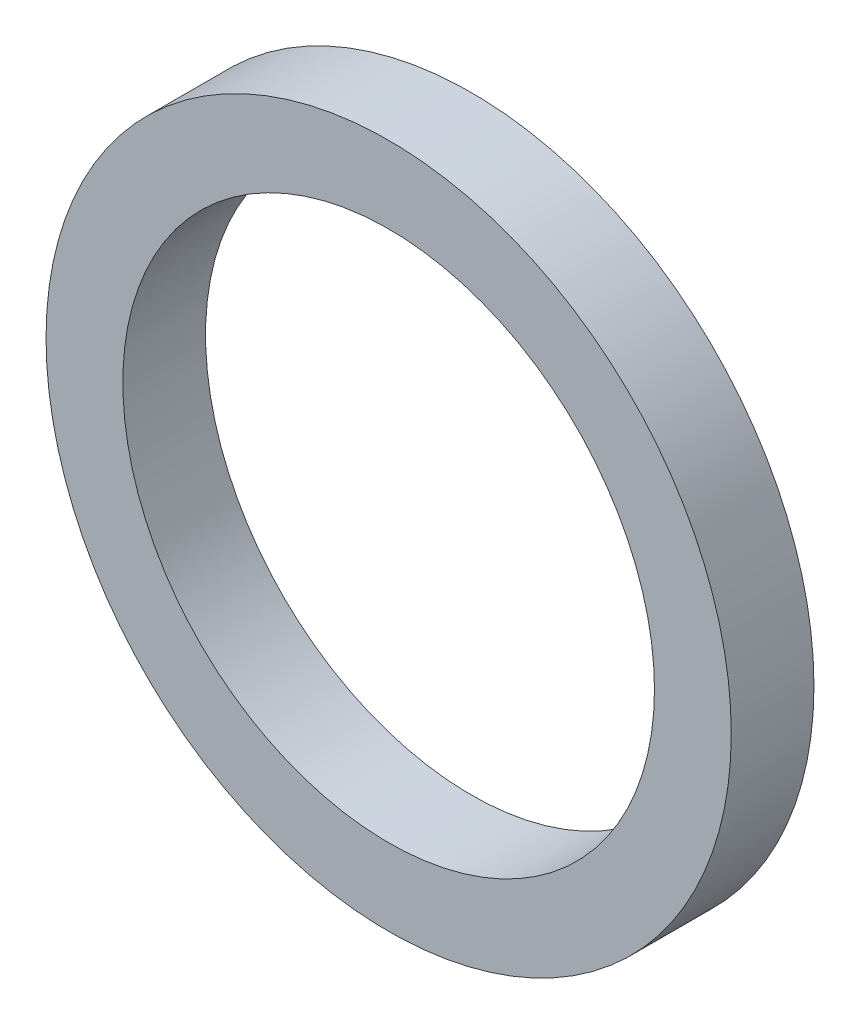
ISO-10303-21;
HEADER;
FILE_DESCRIPTION(('STEP AP214'),'2;1');
FILE_NAME('part.step','',(''),(''),'','','');
FILE_SCHEMA(('AUTOMOTIVE_DESIGN { 1 0 10303 214 1 1 1 1 }'));
ENDSEC;
DATA;
#1=APPLICATION_CONTEXT('core data for automotive mechanical design processes');
#2=APPLICATION_PROTOCOL_DEFINITION('international standard','automotive_design',2000,#1);
#3=PRODUCT_CONTEXT('',#1,'mechanical');
#4=PRODUCT('Part','Part','',(#3));
#5=PRODUCT_RELATED_PRODUCT_CATEGORY('part','',(#4));
#6=PRODUCT_DEFINITION_FORMATION('','',#4);
#7=PRODUCT_DEFINITION_CONTEXT('part definition',#1,'design');
#8=PRODUCT_DEFINITION('design','',#6,#7);
#9=PRODUCT_DEFINITION_SHAPE('','',#8);
#10=(LENGTH_UNIT() NAMED_UNIT(*) SI_UNIT(.MILLI.,.METRE.));
#11=(NAMED_UNIT(*) PLANE_ANGLE_UNIT() SI_UNIT($,.RADIAN.));
#12=(NAMED_UNIT(*) SI_UNIT($,.STERADIAN.) SOLID_ANGLE_UNIT());
#13=UNCERTAINTY_MEASURE_WITH_UNIT(LENGTH_MEASURE(1.E-05),#10,'distance_accuracy_value','');
#14=(GEOMETRIC_REPRESENTATION_CONTEXT(3) GLOBAL_UNCERTAINTY_ASSIGNED_CONTEXT((#13)) GLOBAL_UNIT_ASSIGNED_CONTEXT((#10,
#11,#12)) REPRESENTATION_CONTEXT('',''));
#15=CARTESIAN_POINT('',(0.,0.,0.));
#16=DIRECTION('',(0.,0.,1.));
#17=DIRECTION('',(1.,0.,0.));
#18=AXIS2_PLACEMENT_3D('',#15,#16,#17);
#19=CARTESIAN_POINT('',(0.,0.,7.));
#20=DIRECTION('',(0.,0.,1.));
#21=DIRECTION('',(1.,0.,0.));
#22=AXIS2_PLACEMENT_3D('',#19,#20,#21);
#23=PLANE('',#22);
#24=CARTESIAN_POINT('',(0.,0.,7.));
#25=DIRECTION('',(0.,0.,1.));
#26=DIRECTION('',(1.,0.,0.));
#27=AXIS2_PLACEMENT_3D('',#24,#25,#26);
#28=CIRCLE('',#27,29.);
#29=CARTESIAN_POINT('',(29.,0.,7.));
#30=VERTEX_POINT('',#29);
#31=EDGE_CURVE('E10',#30,#30,#28,.T.);
#32=ORIENTED_EDGE('',*,*,#31,.T.);
#33=EDGE_LOOP('',(#32));
#34=FACE_BOUND('',#33,.T.);
#35=CARTESIAN_POINT('',(0.,0.,7.));
#36=DIRECTION('',(0.,0.,1.));
#37=DIRECTION('',(1.,0.,0.));
#38=AXIS2_PLACEMENT_3D('',#35,#36,#37);
#39=CIRCLE('',#38,22.5);
#40=CARTESIAN_POINT('',(22.5,0.,7.));
#41=VERTEX_POINT('',#40);
#42=EDGE_CURVE('E43',#41,#41,#39,.T.);
#43=ORIENTED_EDGE('',*,*,#42,.F.);
#44=EDGE_LOOP('',(#43));
#45=FACE_BOUND('',#44,.T.);
#46=ADVANCED_FACE('F32',(#34,#45),#23,.T.);
#47=CARTESIAN_POINT('',(0.,0.,0.));
#48=DIRECTION('',(0.,0.,1.));
#49=DIRECTION('',(1.,0.,0.));
#50=AXIS2_PLACEMENT_3D('',#47,#48,#49);
#51=PLANE('',#50);
#52=CARTESIAN_POINT('',(0.,0.,0.));
#53=DIRECTION('',(0.,0.,1.));
#54=DIRECTION('',(1.,0.,0.));
#55=AXIS2_PLACEMENT_3D('',#52,#53,#54);
#56=CIRCLE('',#55,29.);
#57=CARTESIAN_POINT('',(29.,0.,0.));
#58=VERTEX_POINT('',#57);
#59=EDGE_CURVE('E36',#58,#58,#56,.T.);
#60=ORIENTED_EDGE('',*,*,#59,.F.);
#61=EDGE_LOOP('',(#60));
#62=FACE_BOUND('',#61,.T.);
#63=CARTESIAN_POINT('',(0.,0.,0.));
#64=DIRECTION('',(0.,0.,1.));
#65=DIRECTION('',(1.,0.,0.));
#66=AXIS2_PLACEMENT_3D('',#63,#64,#65);
#67=CIRCLE('',#66,22.5);
#68=CARTESIAN_POINT('',(22.5,0.,0.));
#69=VERTEX_POINT('',#68);
#70=EDGE_CURVE('E45',#69,#69,#67,.T.);
#71=ORIENTED_EDGE('',*,*,#70,.T.);
#72=EDGE_LOOP('',(#71));
#73=FACE_BOUND('',#72,.T.);
#74=ADVANCED_FACE('F55',(#62,#73),#51,.F.);
#75=CARTESIAN_POINT('',(0.,0.,7.));
#76=DIRECTION('',(0.,0.,-1.));
#77=DIRECTION('',(-1.,0.,0.));
#78=AXIS2_PLACEMENT_3D('',#75,#76,#77);
#79=CYLINDRICAL_SURFACE('',#78,29.);
#80=ORIENTED_EDGE('',*,*,#31,.F.);
#81=EDGE_LOOP('',(#80));
#82=FACE_BOUND('',#81,.T.);
#83=ORIENTED_EDGE('',*,*,#59,.T.);
#84=EDGE_LOOP('',(#83));
#85=FACE_BOUND('',#84,.T.);
#86=ADVANCED_FACE('F34',(#82,#85),#79,.T.);
#87=CARTESIAN_POINT('',(0.,0.,7.));
#88=DIRECTION('',(0.,0.,-1.));
#89=DIRECTION('',(-1.,0.,0.));
#90=AXIS2_PLACEMENT_3D('',#87,#88,#89);
#91=CYLINDRICAL_SURFACE('',#90,22.5);
#92=ORIENTED_EDGE('',*,*,#42,.T.);
#93=EDGE_LOOP('',(#92));
#94=FACE_BOUND('',#93,.T.);
#95=ORIENTED_EDGE('',*,*,#70,.F.);
#96=EDGE_LOOP('',(#95));
#97=FACE_BOUND('',#96,.T.);
#98=ADVANCED_FACE('F51',(#94,#97),#91,.F.);
#99=CLOSED_SHELL('',(#46,#74,#86,#98));
#100=MANIFOLD_SOLID_BREP('B2',#99);
#101=ADVANCED_BREP_SHAPE_REPRESENTATION('',(#18,#100),#14);
#102=SHAPE_DEFINITION_REPRESENTATION(#9,#101);
ENDSEC;
END-ISO-10303-21;
